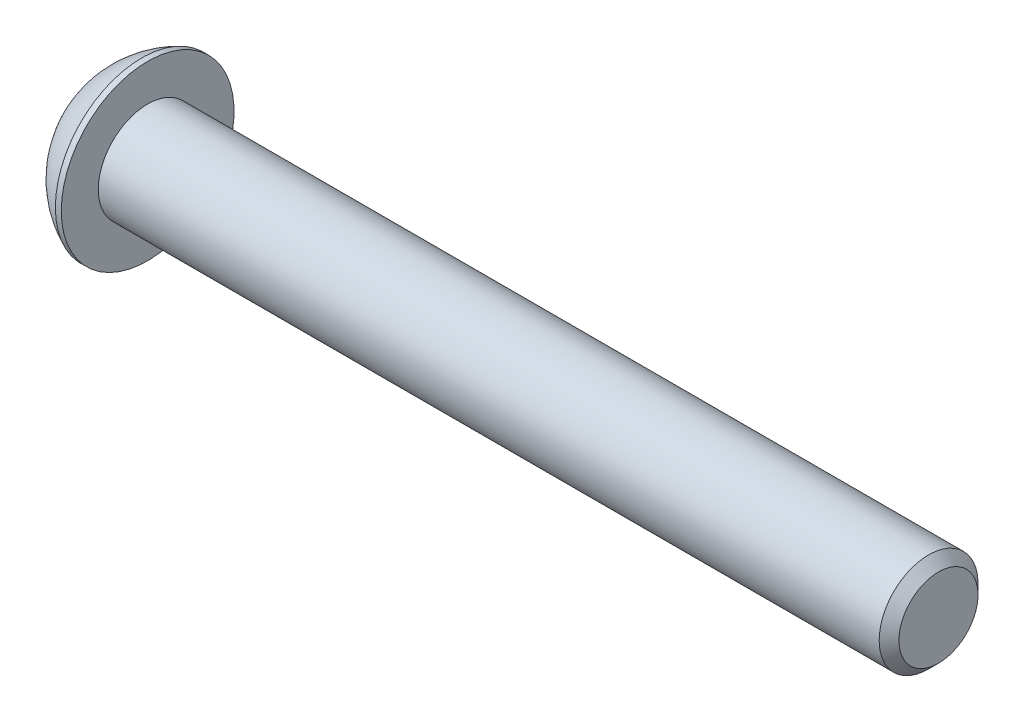
ISO-10303-21;
HEADER;
FILE_DESCRIPTION(('STEP AP214'),'2;1');
FILE_NAME('part.step','',(''),(''),'','','');
FILE_SCHEMA(('AUTOMOTIVE_DESIGN { 1 0 10303 214 1 1 1 1 }'));
ENDSEC;
DATA;
#1=APPLICATION_CONTEXT('core data for automotive mechanical design processes');
#2=APPLICATION_PROTOCOL_DEFINITION('international standard','automotive_design',2000,#1);
#3=PRODUCT_CONTEXT('',#1,'mechanical');
#4=PRODUCT('Part','Part','',(#3));
#5=PRODUCT_RELATED_PRODUCT_CATEGORY('part','',(#4));
#6=PRODUCT_DEFINITION_FORMATION('','',#4);
#7=PRODUCT_DEFINITION_CONTEXT('part definition',#1,'design');
#8=PRODUCT_DEFINITION('design','',#6,#7);
#9=PRODUCT_DEFINITION_SHAPE('','',#8);
#10=(LENGTH_UNIT() NAMED_UNIT(*) SI_UNIT(.MILLI.,.METRE.));
#11=(NAMED_UNIT(*) PLANE_ANGLE_UNIT() SI_UNIT($,.RADIAN.));
#12=(NAMED_UNIT(*) SI_UNIT($,.STERADIAN.) SOLID_ANGLE_UNIT());
#13=UNCERTAINTY_MEASURE_WITH_UNIT(LENGTH_MEASURE(1.E-05),#10,'distance_accuracy_value','');
#14=(GEOMETRIC_REPRESENTATION_CONTEXT(3) GLOBAL_UNCERTAINTY_ASSIGNED_CONTEXT((#13)) GLOBAL_UNIT_ASSIGNED_CONTEXT((#10,
#11,#12)) REPRESENTATION_CONTEXT('',''));
#15=CARTESIAN_POINT('',(0.,0.,0.));
#16=DIRECTION('',(0.,0.,1.));
#17=DIRECTION('',(1.,0.,0.));
#18=AXIS2_PLACEMENT_3D('',#15,#16,#17);
#19=CARTESIAN_POINT('',(1.32079999432833,0.,0.));
#20=DIRECTION('',(-1.,0.,0.));
#21=DIRECTION('',(0.,0.,1.));
#22=AXIS2_PLACEMENT_3D('',#19,#20,#21);
#23=CONICAL_SURFACE('',#22,1.19379999672553,1.04719755119985);
#24=CARTESIAN_POINT('',(2.01004074379096,0.,4.44089209850063E-13));
#25=VERTEX_POINT('',#24);
#26=VERTEX_LOOP('',#25);
#27=FACE_BOUND('',#26,.T.);
#28=CARTESIAN_POINT('',(1.32079999432833,0.,0.));
#29=DIRECTION('',(-1.,0.,0.));
#30=DIRECTION('',(0.,0.,1.));
#31=AXIS2_PLACEMENT_3D('',#28,#29,#30);
#32=CIRCLE('',#31,1.19379999672553);
#33=CARTESIAN_POINT('',(1.32079999432833,0.,1.19379999672553));
#34=VERTEX_POINT('',#33);
#35=EDGE_CURVE('E20',#34,#34,#32,.T.);
#36=ORIENTED_EDGE('',*,*,#35,.T.);
#37=EDGE_LOOP('',(#36));
#38=FACE_BOUND('',#37,.T.);
#39=ADVANCED_FACE('F17',(#27,#38),#23,.F.);
#40=CARTESIAN_POINT('',(1.3208,-2.29135888085,0.));
#41=DIRECTION('',(1.,0.,0.));
#42=DIRECTION('',(0.,0.,-1.));
#43=AXIS2_PLACEMENT_3D('',#40,#41,#42);
#44=PLANE('',#43);
#45=ORIENTED_EDGE('',*,*,#35,.F.);
#46=EDGE_LOOP('',(#45));
#47=FACE_BOUND('',#46,.T.);
#48=DIRECTION('',(0.,1.,0.));
#49=VECTOR('',#48,1.);
#50=CARTESIAN_POINT('',(1.3208,-1.14567944042,1.984375));
#51=LINE('',#50,#49);
#52=CARTESIAN_POINT('',(1.3208,1.1456794404025,1.984375));
#53=VERTEX_POINT('',#52);
#54=CARTESIAN_POINT('',(1.3208,-1.14567944045803,1.98437500000826));
#55=VERTEX_POINT('',#54);
#56=EDGE_CURVE('E134',#53,#55,#51,.F.);
#57=ORIENTED_EDGE('',*,*,#56,.F.);
#58=DIRECTION('',(0.,0.50000000000019,-0.866025403784329));
#59=VECTOR('',#58,1.);
#60=CARTESIAN_POINT('',(1.3208,1.14567944042,1.984375));
#61=LINE('',#60,#59);
#62=CARTESIAN_POINT('',(1.3208,2.29135888083945,1.55612149685055E-11));
#63=VERTEX_POINT('',#62);
#64=EDGE_CURVE('E116',#63,#53,#61,.F.);
#65=ORIENTED_EDGE('',*,*,#64,.F.);
#66=DIRECTION('',(0.,-0.50000000000019,-0.866025403784329));
#67=VECTOR('',#66,1.);
#68=CARTESIAN_POINT('',(1.3208,2.29135888085,0.));
#69=LINE('',#68,#67);
#70=CARTESIAN_POINT('',(1.3208,1.1456794404168,-1.98437500000826));
#71=VERTEX_POINT('',#70);
#72=EDGE_CURVE('E88',#71,#63,#69,.F.);
#73=ORIENTED_EDGE('',*,*,#72,.F.);
#74=DIRECTION('',(0.,1.,0.));
#75=VECTOR('',#74,1.);
#76=CARTESIAN_POINT('',(1.3208,1.14567944042,-1.984375));
#77=LINE('',#76,#75);
#78=CARTESIAN_POINT('',(1.3208,-1.1456794404025,-1.984375));
#79=VERTEX_POINT('',#78);
#80=EDGE_CURVE('E85',#79,#71,#77,.T.);
#81=ORIENTED_EDGE('',*,*,#80,.F.);
#82=DIRECTION('',(0.,-0.50000000000019,0.866025403784329));
#83=VECTOR('',#82,1.);
#84=CARTESIAN_POINT('',(1.3208,-1.14567944042,-1.984375));
#85=LINE('',#84,#83);
#86=CARTESIAN_POINT('',(1.3208,-2.29135888083945,-1.55606780336135E-11));
#87=VERTEX_POINT('',#86);
#88=EDGE_CURVE('E124',#87,#79,#85,.F.);
#89=ORIENTED_EDGE('',*,*,#88,.F.);
#90=DIRECTION('',(0.,0.50000000000019,0.866025403784329));
#91=VECTOR('',#90,1.);
#92=CARTESIAN_POINT('',(1.3208,-2.29135888085,0.));
#93=LINE('',#92,#91);
#94=EDGE_CURVE('E129',#55,#87,#93,.F.);
#95=ORIENTED_EDGE('',*,*,#94,.F.);
#96=EDGE_LOOP('',(#57,#65,#73,#81,#89,#95));
#97=FACE_BOUND('',#96,.T.);
#98=ADVANCED_FACE('F173',(#47,#97),#44,.F.);
#99=CARTESIAN_POINT('',(1.3208,-1.14567944042,1.984375));
#100=DIRECTION('',(0.,0.,-1.));
#101=DIRECTION('',(0.,1.,0.));
#102=AXIS2_PLACEMENT_3D('',#99,#100,#101);
#103=PLANE('',#102);
#104=ORIENTED_EDGE('',*,*,#56,.T.);
#105=DIRECTION('',(1.,0.,0.));
#106=VECTOR('',#105,1.);
#107=CARTESIAN_POINT('',(1.3208,-1.14567944040719,1.98437500003302));
#108=LINE('',#107,#106);
#109=CARTESIAN_POINT('',(0.,-1.1456794404393,1.98437500000826));
#110=VERTEX_POINT('',#109);
#111=EDGE_CURVE('E131',#110,#55,#108,.T.);
#112=ORIENTED_EDGE('',*,*,#111,.F.);
#113=DIRECTION('',(0.,1.,0.));
#114=VECTOR('',#113,1.);
#115=CARTESIAN_POINT('',(0.,0.,1.984375));
#116=LINE('',#115,#114);
#117=CARTESIAN_POINT('',(0.,1.1456794403675,1.984375));
#118=VERTEX_POINT('',#117);
#119=EDGE_CURVE('E110',#118,#110,#116,.F.);
#120=ORIENTED_EDGE('',*,*,#119,.F.);
#121=DIRECTION('',(1.,0.,0.));
#122=VECTOR('',#121,1.);
#123=CARTESIAN_POINT('',(1.3208,1.14567944042,1.984375));
#124=LINE('',#123,#122);
#125=EDGE_CURVE('E113',#53,#118,#124,.F.);
#126=ORIENTED_EDGE('',*,*,#125,.F.);
#127=EDGE_LOOP('',(#104,#112,#120,#126));
#128=FACE_BOUND('',#127,.T.);
#129=ADVANCED_FACE('F170',(#128),#103,.T.);
#130=CARTESIAN_POINT('',(1.3208,-2.29135888085,0.));
#131=DIRECTION('',(0.,0.866025403784329,-0.50000000000019));
#132=DIRECTION('',(0.,0.50000000000019,0.866025403784329));
#133=AXIS2_PLACEMENT_3D('',#130,#131,#132);
#134=PLANE('',#133);
#135=ORIENTED_EDGE('',*,*,#94,.T.);
#136=DIRECTION('',(1.,0.,0.));
#137=VECTOR('',#136,1.);
#138=CARTESIAN_POINT('',(1.3208,-2.29135888080781,-6.22431793606548E-11));
#139=LINE('',#138,#137);
#140=CARTESIAN_POINT('',(0.,-2.29135888080195,-1.55607234461392E-11));
#141=VERTEX_POINT('',#140);
#142=EDGE_CURVE('E126',#141,#87,#139,.T.);
#143=ORIENTED_EDGE('',*,*,#142,.F.);
#144=DIRECTION('',(0.,-0.499999999976052,-0.866025403798265));
#145=VECTOR('',#144,1.);
#146=CARTESIAN_POINT('',(0.,-1.14567944035,1.984375));
#147=LINE('',#146,#145);
#148=EDGE_CURVE('E105',#110,#141,#147,.T.);
#149=ORIENTED_EDGE('',*,*,#148,.F.);
#150=ORIENTED_EDGE('',*,*,#111,.T.);
#151=EDGE_LOOP('',(#135,#143,#149,#150));
#152=FACE_BOUND('',#151,.T.);
#153=ADVANCED_FACE('F166',(#152),#134,.T.);
#154=CARTESIAN_POINT('',(1.3208,-1.14567944042,-1.984375));
#155=DIRECTION('',(0.,0.866025403784329,0.50000000000019));
#156=DIRECTION('',(0.,-0.50000000000019,0.866025403784329));
#157=AXIS2_PLACEMENT_3D('',#154,#155,#156);
#158=PLANE('',#157);
#159=ORIENTED_EDGE('',*,*,#88,.T.);
#160=DIRECTION('',(1.,0.,0.));
#161=VECTOR('',#160,1.);
#162=CARTESIAN_POINT('',(1.3208,-1.14567944035,-1.984375));
#163=LINE('',#162,#161);
#164=CARTESIAN_POINT('',(0.,-1.145679440385,-1.984375));
#165=VERTEX_POINT('',#164);
#166=EDGE_CURVE('E122',#165,#79,#163,.T.);
#167=ORIENTED_EDGE('',*,*,#166,.F.);
#168=DIRECTION('',(0.,0.499999999976052,-0.866025403798265));
#169=VECTOR('',#168,1.);
#170=CARTESIAN_POINT('',(0.,-2.2913588807,0.));
#171=LINE('',#170,#169);
#172=EDGE_CURVE('E103',#141,#165,#171,.T.);
#173=ORIENTED_EDGE('',*,*,#172,.F.);
#174=ORIENTED_EDGE('',*,*,#142,.T.);
#175=EDGE_LOOP('',(#159,#167,#173,#174));
#176=FACE_BOUND('',#175,.T.);
#177=ADVANCED_FACE('F163',(#176),#158,.T.);
#178=CARTESIAN_POINT('',(1.3208,1.14567944042,-1.984375));
#179=DIRECTION('',(0.,0.,1.));
#180=DIRECTION('',(1.,0.,0.));
#181=AXIS2_PLACEMENT_3D('',#178,#179,#180);
#182=PLANE('',#181);
#183=ORIENTED_EDGE('',*,*,#80,.T.);
#184=DIRECTION('',(1.,0.,0.));
#185=VECTOR('',#184,1.);
#186=CARTESIAN_POINT('',(1.3208,1.14567944040719,-1.98437500003302));
#187=LINE('',#186,#185);
#188=CARTESIAN_POINT('',(0.,1.1456794403993,-1.98437500000826));
#189=VERTEX_POINT('',#188);
#190=EDGE_CURVE('E77',#189,#71,#187,.T.);
#191=ORIENTED_EDGE('',*,*,#190,.F.);
#192=DIRECTION('',(0.,1.,0.));
#193=VECTOR('',#192,1.);
#194=CARTESIAN_POINT('',(0.,0.,-1.984375));
#195=LINE('',#194,#193);
#196=EDGE_CURVE('E82',#165,#189,#195,.T.);
#197=ORIENTED_EDGE('',*,*,#196,.F.);
#198=ORIENTED_EDGE('',*,*,#166,.T.);
#199=EDGE_LOOP('',(#183,#191,#197,#198));
#200=FACE_BOUND('',#199,.T.);
#201=ADVANCED_FACE('F79',(#200),#182,.T.);
#202=CARTESIAN_POINT('',(1.3208,2.29135888085,0.));
#203=DIRECTION('',(0.,-0.866025403784329,0.50000000000019));
#204=DIRECTION('',(0.,-0.50000000000019,-0.866025403784329));
#205=AXIS2_PLACEMENT_3D('',#202,#203,#204);
#206=PLANE('',#205);
#207=ORIENTED_EDGE('',*,*,#72,.T.);
#208=DIRECTION('',(1.,0.,0.));
#209=VECTOR('',#208,1.);
#210=CARTESIAN_POINT('',(1.3208,2.29135888080781,6.22431793606548E-11));
#211=LINE('',#210,#209);
#212=CARTESIAN_POINT('',(0.,2.29135888080195,1.55609402865737E-11));
#213=VERTEX_POINT('',#212);
#214=EDGE_CURVE('E94',#213,#63,#211,.T.);
#215=ORIENTED_EDGE('',*,*,#214,.F.);
#216=DIRECTION('',(0.,0.499999999976052,0.866025403798265));
#217=VECTOR('',#216,1.);
#218=CARTESIAN_POINT('',(0.,1.14567944035,-1.984375));
#219=LINE('',#218,#217);
#220=EDGE_CURVE('E91',#189,#213,#219,.T.);
#221=ORIENTED_EDGE('',*,*,#220,.F.);
#222=ORIENTED_EDGE('',*,*,#190,.T.);
#223=EDGE_LOOP('',(#207,#215,#221,#222));
#224=FACE_BOUND('',#223,.T.);
#225=ADVANCED_FACE('F92',(#224),#206,.T.);
#226=CARTESIAN_POINT('',(1.3208,1.14567944042,1.984375));
#227=DIRECTION('',(0.,-0.866025403784329,-0.50000000000019));
#228=DIRECTION('',(0.,0.50000000000019,-0.866025403784329));
#229=AXIS2_PLACEMENT_3D('',#226,#227,#228);
#230=PLANE('',#229);
#231=ORIENTED_EDGE('',*,*,#64,.T.);
#232=ORIENTED_EDGE('',*,*,#125,.T.);
#233=DIRECTION('',(0.,-0.499999999976052,0.866025403798265));
#234=VECTOR('',#233,1.);
#235=CARTESIAN_POINT('',(0.,2.2913588807,0.));
#236=LINE('',#235,#234);
#237=EDGE_CURVE('E98',#213,#118,#236,.T.);
#238=ORIENTED_EDGE('',*,*,#237,.F.);
#239=ORIENTED_EDGE('',*,*,#214,.T.);
#240=EDGE_LOOP('',(#231,#232,#238,#239));
#241=FACE_BOUND('',#240,.T.);
#242=ADVANCED_FACE('F155',(#241),#230,.T.);
#243=CARTESIAN_POINT('',(0.,0.,0.));
#244=DIRECTION('',(-1.,0.,0.));
#245=DIRECTION('',(0.,0.,1.));
#246=AXIS2_PLACEMENT_3D('',#243,#244,#245);
#247=PLANE('',#246);
#248=ORIENTED_EDGE('',*,*,#220,.T.);
#249=ORIENTED_EDGE('',*,*,#237,.T.);
#250=ORIENTED_EDGE('',*,*,#119,.T.);
#251=ORIENTED_EDGE('',*,*,#148,.T.);
#252=ORIENTED_EDGE('',*,*,#172,.T.);
#253=ORIENTED_EDGE('',*,*,#196,.T.);
#254=EDGE_LOOP('',(#248,#249,#250,#251,#252,#253));
#255=FACE_BOUND('',#254,.T.);
#256=CARTESIAN_POINT('',(0.,0.,2.77495000000498));
#257=CARTESIAN_POINT('',(0.,-0.0780476189418023,2.7749574777346));
#258=CARTESIAN_POINT('',(0.,-0.156091690997,2.77165730271175));
#259=CARTESIAN_POINT('',(0.,-0.311621483993028,2.75849951311291));
#260=CARTESIAN_POINT('',(0.,-0.38910723148015,2.74864221241182));
#261=CARTESIAN_POINT('',(0.,-0.542923175998717,2.72243714479626));
#262=CARTESIAN_POINT('',(0.,-0.619254139371762,2.70609389762394));
#263=CARTESIAN_POINT('',(0.,-0.770249304507315,2.66704952043296));
#264=CARTESIAN_POINT('',(0.,-0.844913526539225,2.64434846777771));
#265=CARTESIAN_POINT('',(0.,-1.06568596776161,2.5668918761079));
#266=CARTESIAN_POINT('',(0.,-1.20863620572707,2.50277224258278));
#267=CARTESIAN_POINT('',(0.,-1.48162845017614,2.35149042805168));
#268=CARTESIAN_POINT('',(0.,-1.61167355634549,2.26433379882055));
#269=CARTESIAN_POINT('',(0.,-1.85530048203785,2.06942681171443));
#270=CARTESIAN_POINT('',(0.,-1.96888346338675,1.96167790839914));
#271=CARTESIAN_POINT('',(0.,-2.17638612604483,1.72859715533842));
#272=CARTESIAN_POINT('',(0.,-2.27029827782891,1.60325860323943));
#273=CARTESIAN_POINT('',(0.,-2.43577545577329,1.33855376914359));
#274=CARTESIAN_POINT('',(0.,-2.50733172131476,1.19918201616334));
#275=CARTESIAN_POINT('',(0.,-2.62594987301431,0.910512315267797));
#276=CARTESIAN_POINT('',(0.,-2.67304017955261,0.761226112752659));
#277=CARTESIAN_POINT('',(0.,-2.72974480799017,0.509262206015232));
#278=CARTESIAN_POINT('',(0.,-2.7466741066797,0.408170256195464));
#279=CARTESIAN_POINT('',(0.,-2.76927900228181,0.204733741062011));
#280=CARTESIAN_POINT('',(0.,-2.77495436270396,0.102389149470764));
#281=CARTESIAN_POINT('',(0.,-2.77494335790323,-0.1558849582706));
#282=CARTESIAN_POINT('',(-3.37327630179731E-13,-2.76177150806704,-0.31187319864273));
#283=CARTESIAN_POINT('',(3.38562160741123E-13,-2.70941293854891,-0.619540159108329));
#284=CARTESIAN_POINT('',(1.27983070085801E-12,-2.67019795455288,-0.771214010135769));
#285=CARTESIAN_POINT('',(1.28221982382751E-12,-2.56687014830246,-1.0657693076378));
#286=CARTESIAN_POINT('',(3.44164875918747E-13,-2.50276825401477,-1.20865458136379));
#287=CARTESIAN_POINT('',(-3.43225758051063E-13,-2.35149927682559,-1.48160130773281));
#288=CARTESIAN_POINT('',(0.,-2.26433701172623,-1.61166543120533));
#289=CARTESIAN_POINT('',(0.,-2.06941027445284,-1.85532526242913));
#290=CARTESIAN_POINT('',(0.,-1.96164444068513,-1.96891988091485));
#291=CARTESIAN_POINT('',(0.,-1.72855917863899,-2.176413309275));
#292=CARTESIAN_POINT('',(0.,-1.60323840676039,-2.27031061020308));
#293=CARTESIAN_POINT('',(0.,-1.33859668560166,-2.43574892033037));
#294=CARTESIAN_POINT('',(0.,-1.19927266628187,-2.50728501291905));
#295=CARTESIAN_POINT('',(0.,-0.910609613461349,-2.62591932801922));
#296=CARTESIAN_POINT('',(0.,-0.761275783745211,-2.67303013888595));
#297=CARTESIAN_POINT('',(0.,-0.509186402769317,-2.72976111987087));
#298=CARTESIAN_POINT('',(0.,-0.408016727031738,-2.74669741402727));
#299=CARTESIAN_POINT('',(0.,-0.204578776250972,-2.76928996300059));
#300=CARTESIAN_POINT('',(0.,-0.102312365024706,-2.77496300589831));
#301=CARTESIAN_POINT('',(0.,0.,-2.77495000000498));
#302=B_SPLINE_CURVE_WITH_KNOTS('',3,(#256,#257,#258,#259,#260,#261,#262,#263,#264,#265,#266,
#267,#268,#269,#270,#271,#272,#273,#274,#275,#276,#277,#278,#279,#280,#281,#282,#283,#284,#285,
#286,#287,#288,#289,#290,#291,#292,#293,#294,#295,#296,#297,#298,#299,#300,#301),.UNSPECIFIED.,
.F.,.F.,(4,2,2,2,2,2,2,2,2,2,2,2,2,2,2,2,2,2,2,2,2,2,4),(0.,0.234066711495954,0.468122219550207,
0.702014911241611,0.935904756990152,1.40349738510624,1.87097742884399,2.33842446377097,
2.80605010062436,3.27385875712272,3.74112277139293,4.0480390880636,4.35496185421012,
4.8222442062987,5.29003452512533,5.75761966678295,6.22510719699141,6.69262563195384,
7.16017986888879,7.62783683586065,8.09525254056861,8.40240115938039,8.70909162286251),.UNSPECIFIED.);
#303=CARTESIAN_POINT('',(0.,0.,2.77495000000498));
#304=VERTEX_POINT('',#303);
#305=CARTESIAN_POINT('',(0.,0.,-2.77495000000498));
#306=VERTEX_POINT('',#305);
#307=EDGE_CURVE('E32',#304,#306,#302,.T.);
#308=ORIENTED_EDGE('',*,*,#307,.F.);
#309=CARTESIAN_POINT('',(0.,0.,0.));
#310=DIRECTION('',(-1.,0.,0.));
#311=DIRECTION('',(0.,-1.,0.));
#312=AXIS2_PLACEMENT_3D('',#309,#310,#311);
#313=CIRCLE('',#312,2.77495000000498);
#314=EDGE_CURVE('E35',#306,#304,#313,.F.);
#315=ORIENTED_EDGE('',*,*,#314,.F.);
#316=EDGE_LOOP('',(#308,#315));
#317=FACE_BOUND('',#316,.T.);
#318=ADVANCED_FACE('F100',(#255,#317),#247,.T.);
#319=CARTESIAN_POINT('',(5.3726088141,0.,0.));
#320=DIRECTION('',(-1.,0.,0.));
#321=DIRECTION('',(0.,1.,0.));
#322=AXIS2_PLACEMENT_3D('',#319,#320,#321);
#323=SPHERICAL_SURFACE('',#322,6.04692260343);
#324=ORIENTED_EDGE('',*,*,#314,.T.);
#325=ORIENTED_EDGE('',*,*,#307,.T.);
#326=EDGE_LOOP('',(#324,#325));
#327=FACE_BOUND('',#326,.T.);
#328=CARTESIAN_POINT('',(2.97179999948,0.,0.));
#329=DIRECTION('',(-1.,0.,0.));
#330=DIRECTION('',(0.,0.,1.));
#331=AXIS2_PLACEMENT_3D('',#328,#329,#330);
#332=CIRCLE('',#331,5.5499);
#333=CARTESIAN_POINT('',(2.97179999948,0.,5.5499));
#334=VERTEX_POINT('',#333);
#335=EDGE_CURVE('E142',#334,#334,#332,.F.);
#336=ORIENTED_EDGE('',*,*,#335,.F.);
#337=EDGE_LOOP('',(#336));
#338=FACE_BOUND('',#337,.T.);
#339=ADVANCED_FACE('F154',(#327,#338),#323,.T.);
#340=CARTESIAN_POINT('',(54.1528,0.,0.));
#341=DIRECTION('',(-1.,0.,0.));
#342=DIRECTION('',(0.,0.,1.));
#343=AXIS2_PLACEMENT_3D('',#340,#341,#342);
#344=PLANE('',#343);
#345=CARTESIAN_POINT('',(54.1527999999971,0.,0.));
#346=DIRECTION('',(-1.,0.,0.));
#347=DIRECTION('',(0.,-1.,0.));
#348=AXIS2_PLACEMENT_3D('',#345,#346,#347);
#349=CIRCLE('',#348,2.54000000006727);
#350=CARTESIAN_POINT('',(54.1527999999971,-2.54000000006727,0.));
#351=VERTEX_POINT('',#350);
#352=EDGE_CURVE('E139',#351,#351,#349,.T.);
#353=ORIENTED_EDGE('',*,*,#352,.F.);
#354=EDGE_LOOP('',(#353));
#355=FACE_BOUND('',#354,.T.);
#356=ADVANCED_FACE('F203',(#355),#344,.F.);
#357=CARTESIAN_POINT('',(0.,0.,0.));
#358=DIRECTION('',(-1.,0.,0.));
#359=DIRECTION('',(0.,0.,1.));
#360=AXIS2_PLACEMENT_3D('',#357,#358,#359);
#361=CYLINDRICAL_SURFACE('',#360,5.5499);
#362=ORIENTED_EDGE('',*,*,#335,.T.);
#363=EDGE_LOOP('',(#362));
#364=FACE_BOUND('',#363,.T.);
#365=CARTESIAN_POINT('',(3.35280000046,0.,0.));
#366=DIRECTION('',(-1.,0.,0.));
#367=DIRECTION('',(0.,0.,1.));
#368=AXIS2_PLACEMENT_3D('',#365,#366,#367);
#369=CIRCLE('',#368,5.5499);
#370=CARTESIAN_POINT('',(3.35280000046,0.,5.5499));
#371=VERTEX_POINT('',#370);
#372=EDGE_CURVE('E136',#371,#371,#369,.T.);
#373=ORIENTED_EDGE('',*,*,#372,.T.);
#374=EDGE_LOOP('',(#373));
#375=FACE_BOUND('',#374,.T.);
#376=ADVANCED_FACE('F199',(#364,#375),#361,.T.);
#377=CARTESIAN_POINT('',(53.5178000001224,0.,0.));
#378=DIRECTION('',(-1.,0.,0.));
#379=DIRECTION('',(0.,-1.,0.));
#380=AXIS2_PLACEMENT_3D('',#377,#378,#379);
#381=CONICAL_SURFACE('',#380,3.17499999988513,0.78539816335269);
#382=CARTESIAN_POINT('',(53.5178,0.,0.));
#383=DIRECTION('',(-1.,0.,0.));
#384=DIRECTION('',(0.,0.,1.));
#385=AXIS2_PLACEMENT_3D('',#382,#383,#384);
#386=CIRCLE('',#385,3.175);
#387=CARTESIAN_POINT('',(53.5178,0.,3.175));
#388=VERTEX_POINT('',#387);
#389=EDGE_CURVE('E25',#388,#388,#386,.T.);
#390=ORIENTED_EDGE('',*,*,#389,.F.);
#391=EDGE_LOOP('',(#390));
#392=FACE_BOUND('',#391,.T.);
#393=ORIENTED_EDGE('',*,*,#352,.T.);
#394=EDGE_LOOP('',(#393));
#395=FACE_BOUND('',#394,.T.);
#396=ADVANCED_FACE('F192',(#392,#395),#381,.T.);
#397=CARTESIAN_POINT('',(3.3528,3.175,0.));
#398=DIRECTION('',(-1.,0.,0.));
#399=DIRECTION('',(0.,0.,1.));
#400=AXIS2_PLACEMENT_3D('',#397,#398,#399);
#401=PLANE('',#400);
#402=CARTESIAN_POINT('',(3.35280000046,0.,0.));
#403=DIRECTION('',(-1.,0.,0.));
#404=DIRECTION('',(0.,0.,1.));
#405=AXIS2_PLACEMENT_3D('',#402,#403,#404);
#406=CIRCLE('',#405,3.175);
#407=CARTESIAN_POINT('',(3.35280000046,0.,3.175));
#408=VERTEX_POINT('',#407);
#409=EDGE_CURVE('E11',#408,#408,#406,.F.);
#410=ORIENTED_EDGE('',*,*,#409,.F.);
#411=EDGE_LOOP('',(#410));
#412=FACE_BOUND('',#411,.T.);
#413=ORIENTED_EDGE('',*,*,#372,.F.);
#414=EDGE_LOOP('',(#413));
#415=FACE_BOUND('',#414,.T.);
#416=ADVANCED_FACE('F186',(#412,#415),#401,.F.);
#417=CARTESIAN_POINT('',(0.,0.,0.));
#418=DIRECTION('',(-1.,0.,0.));
#419=DIRECTION('',(0.,0.,1.));
#420=AXIS2_PLACEMENT_3D('',#417,#418,#419);
#421=CYLINDRICAL_SURFACE('',#420,3.175);
#422=ORIENTED_EDGE('',*,*,#409,.T.);
#423=EDGE_LOOP('',(#422));
#424=FACE_BOUND('',#423,.T.);
#425=ORIENTED_EDGE('',*,*,#389,.T.);
#426=EDGE_LOOP('',(#425));
#427=FACE_BOUND('',#426,.T.);
#428=ADVANCED_FACE('F184',(#424,#427),#421,.T.);
#429=CLOSED_SHELL('',(#39,#98,#129,#153,#177,#201,#225,#242,#318,#339,#356,#376,#396,#416,#428));
#430=MANIFOLD_SOLID_BREP('B1',#429);
#431=ADVANCED_BREP_SHAPE_REPRESENTATION('',(#18,#430),#14);
#432=SHAPE_DEFINITION_REPRESENTATION(#9,#431);
ENDSEC;
END-ISO-10303-21;
